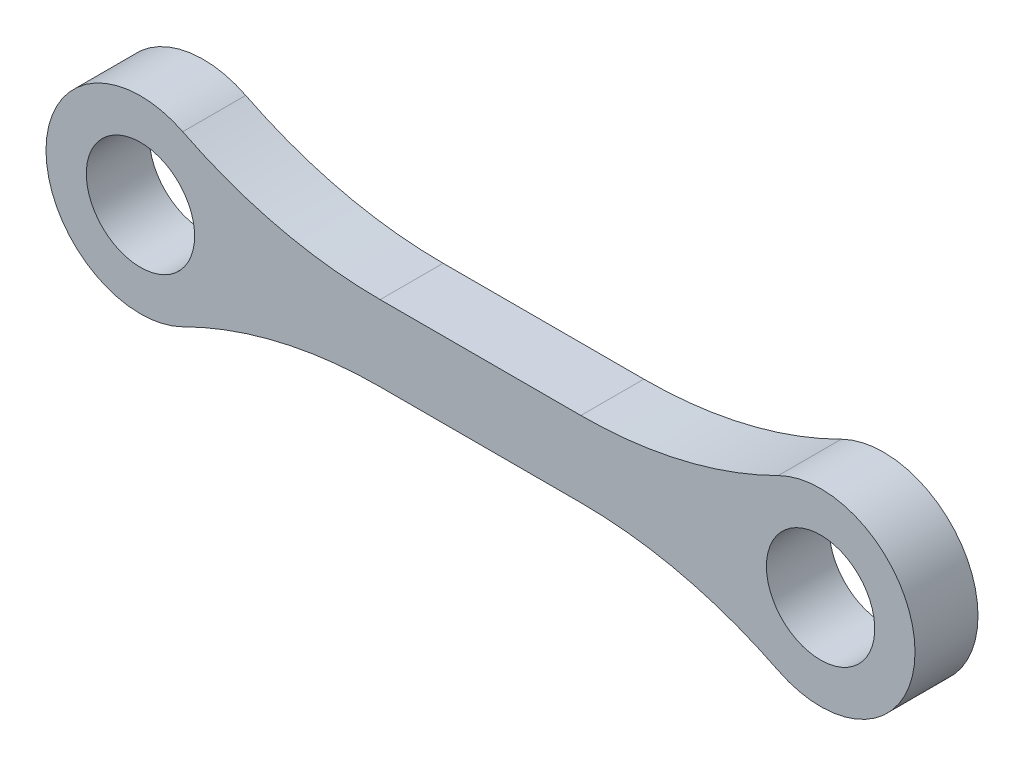
ISO-10303-21;
HEADER;
FILE_DESCRIPTION(('STEP AP214'),'2;1');
FILE_NAME('part.step','',(''),(''),'','','');
FILE_SCHEMA(('AUTOMOTIVE_DESIGN { 1 0 10303 214 1 1 1 1 }'));
ENDSEC;
DATA;
#1=APPLICATION_CONTEXT('core data for automotive mechanical design processes');
#2=APPLICATION_PROTOCOL_DEFINITION('international standard','automotive_design',2000,#1);
#3=PRODUCT_CONTEXT('',#1,'mechanical');
#4=PRODUCT('Part','Part','',(#3));
#5=PRODUCT_RELATED_PRODUCT_CATEGORY('part','',(#4));
#6=PRODUCT_DEFINITION_FORMATION('','',#4);
#7=PRODUCT_DEFINITION_CONTEXT('part definition',#1,'design');
#8=PRODUCT_DEFINITION('design','',#6,#7);
#9=PRODUCT_DEFINITION_SHAPE('','',#8);
#10=(LENGTH_UNIT() NAMED_UNIT(*) SI_UNIT(.MILLI.,.METRE.));
#11=(NAMED_UNIT(*) PLANE_ANGLE_UNIT() SI_UNIT($,.RADIAN.));
#12=(NAMED_UNIT(*) SI_UNIT($,.STERADIAN.) SOLID_ANGLE_UNIT());
#13=UNCERTAINTY_MEASURE_WITH_UNIT(LENGTH_MEASURE(1.E-05),#10,'distance_accuracy_value','');
#14=(GEOMETRIC_REPRESENTATION_CONTEXT(3) GLOBAL_UNCERTAINTY_ASSIGNED_CONTEXT((#13)) GLOBAL_UNIT_ASSIGNED_CONTEXT((#10,
#11,#12)) REPRESENTATION_CONTEXT('',''));
#15=CARTESIAN_POINT('',(0.,0.,0.));
#16=DIRECTION('',(0.,0.,1.));
#17=DIRECTION('',(1.,0.,0.));
#18=AXIS2_PLACEMENT_3D('',#15,#16,#17);
#19=CARTESIAN_POINT('',(7.96713368932572,-38.,5.));
#20=DIRECTION('',(0.,0.,-1.));
#21=DIRECTION('',(-1.,0.,0.));
#22=AXIS2_PLACEMENT_3D('',#19,#20,#21);
#23=PLANE('',#22);
#24=CARTESIAN_POINT('',(7.96713368932572,-38.,5.));
#25=DIRECTION('',(0.,0.,-1.));
#26=DIRECTION('',(-1.,0.,0.));
#27=AXIS2_PLACEMENT_3D('',#24,#25,#26);
#28=CIRCLE('',#27,35.);
#29=CARTESIAN_POINT('',(7.96713368932571,-3.,5.));
#30=VERTEX_POINT('',#29);
#31=CARTESIAN_POINT('',(23.6412588863516,-6.70588235294118,5.));
#32=VERTEX_POINT('',#31);
#33=EDGE_CURVE('E145',#30,#32,#28,.T.);
#34=ORIENTED_EDGE('',*,*,#33,.T.);
#35=CARTESIAN_POINT('',(27.,0.,5.));
#36=DIRECTION('',(0.,0.,1.));
#37=DIRECTION('',(-1.,0.,0.));
#38=AXIS2_PLACEMENT_3D('',#35,#36,#37);
#39=CIRCLE('',#38,7.5);
#40=CARTESIAN_POINT('',(23.6412588863516,6.70588235294117,5.));
#41=VERTEX_POINT('',#40);
#42=EDGE_CURVE('E93',#32,#41,#39,.T.);
#43=ORIENTED_EDGE('',*,*,#42,.T.);
#44=CARTESIAN_POINT('',(7.96713368932575,38.,5.));
#45=DIRECTION('',(0.,0.,-1.));
#46=DIRECTION('',(1.,0.,0.));
#47=AXIS2_PLACEMENT_3D('',#44,#45,#46);
#48=CIRCLE('',#47,35.);
#49=CARTESIAN_POINT('',(7.96713368932576,3.,5.));
#50=VERTEX_POINT('',#49);
#51=EDGE_CURVE('E160',#41,#50,#48,.T.);
#52=ORIENTED_EDGE('',*,*,#51,.T.);
#53=DIRECTION('',(-1.,0.,0.));
#54=VECTOR('',#53,1.);
#55=CARTESIAN_POINT('',(-7.96713368932575,3.,5.));
#56=LINE('',#55,#54);
#57=CARTESIAN_POINT('',(-7.96713368932576,3.,5.));
#58=VERTEX_POINT('',#57);
#59=EDGE_CURVE('E173',#50,#58,#56,.T.);
#60=ORIENTED_EDGE('',*,*,#59,.T.);
#61=CARTESIAN_POINT('',(-7.96713368932575,38.,5.));
#62=DIRECTION('',(0.,0.,-1.));
#63=DIRECTION('',(1.,0.,0.));
#64=AXIS2_PLACEMENT_3D('',#61,#62,#63);
#65=CIRCLE('',#64,35.);
#66=CARTESIAN_POINT('',(-23.6412588863516,6.70588235294117,5.));
#67=VERTEX_POINT('',#66);
#68=EDGE_CURVE('E112',#58,#67,#65,.T.);
#69=ORIENTED_EDGE('',*,*,#68,.T.);
#70=CARTESIAN_POINT('',(-27.,0.,5.));
#71=DIRECTION('',(0.,0.,1.));
#72=DIRECTION('',(1.,0.,0.));
#73=AXIS2_PLACEMENT_3D('',#70,#71,#72);
#74=CIRCLE('',#73,7.5);
#75=CARTESIAN_POINT('',(-23.6412588863516,-6.70588235294119,5.));
#76=VERTEX_POINT('',#75);
#77=EDGE_CURVE('E106',#67,#76,#74,.T.);
#78=ORIENTED_EDGE('',*,*,#77,.T.);
#79=CARTESIAN_POINT('',(-7.9671336893257,-38.,5.));
#80=DIRECTION('',(0.,0.,-1.));
#81=DIRECTION('',(-1.,0.,0.));
#82=AXIS2_PLACEMENT_3D('',#79,#80,#81);
#83=CIRCLE('',#82,35.);
#84=CARTESIAN_POINT('',(-7.9671336893257,-3.,5.));
#85=VERTEX_POINT('',#84);
#86=EDGE_CURVE('E110',#76,#85,#83,.T.);
#87=ORIENTED_EDGE('',*,*,#86,.T.);
#88=DIRECTION('',(1.,0.,0.));
#89=VECTOR('',#88,1.);
#90=CARTESIAN_POINT('',(-7.9671336893257,-3.,5.));
#91=LINE('',#90,#89);
#92=EDGE_CURVE('E50',#85,#30,#91,.T.);
#93=ORIENTED_EDGE('',*,*,#92,.T.);
#94=EDGE_LOOP('',(#34,#43,#52,#60,#69,#78,#87,#93));
#95=FACE_BOUND('',#94,.T.);
#96=CARTESIAN_POINT('',(-27.,0.,5.));
#97=DIRECTION('',(0.,0.,1.));
#98=DIRECTION('',(1.,0.,0.));
#99=AXIS2_PLACEMENT_3D('',#96,#97,#98);
#100=CIRCLE('',#99,4.3);
#101=CARTESIAN_POINT('',(-22.7,0.,5.));
#102=VERTEX_POINT('',#101);
#103=EDGE_CURVE('E134',#102,#102,#100,.T.);
#104=ORIENTED_EDGE('',*,*,#103,.F.);
#105=EDGE_LOOP('',(#104));
#106=FACE_BOUND('',#105,.T.);
#107=CARTESIAN_POINT('',(27.,0.,5.));
#108=DIRECTION('',(0.,0.,1.));
#109=DIRECTION('',(-1.,0.,0.));
#110=AXIS2_PLACEMENT_3D('',#107,#108,#109);
#111=CIRCLE('',#110,4.3);
#112=CARTESIAN_POINT('',(22.7,0.,5.));
#113=VERTEX_POINT('',#112);
#114=EDGE_CURVE('E182',#113,#113,#111,.T.);
#115=ORIENTED_EDGE('',*,*,#114,.F.);
#116=EDGE_LOOP('',(#115));
#117=FACE_BOUND('',#116,.T.);
#118=ADVANCED_FACE('F33',(#95,#106,#117),#23,.F.);
#119=CARTESIAN_POINT('',(7.96713368932572,-38.,0.));
#120=DIRECTION('',(0.,0.,-1.));
#121=DIRECTION('',(-1.,0.,0.));
#122=AXIS2_PLACEMENT_3D('',#119,#120,#121);
#123=PLANE('',#122);
#124=CARTESIAN_POINT('',(-27.,0.,0.));
#125=DIRECTION('',(0.,0.,1.));
#126=DIRECTION('',(1.,0.,0.));
#127=AXIS2_PLACEMENT_3D('',#124,#125,#126);
#128=CIRCLE('',#127,4.3);
#129=CARTESIAN_POINT('',(-22.7,0.,0.));
#130=VERTEX_POINT('',#129);
#131=EDGE_CURVE('E179',#130,#130,#128,.T.);
#132=ORIENTED_EDGE('',*,*,#131,.T.);
#133=EDGE_LOOP('',(#132));
#134=FACE_BOUND('',#133,.T.);
#135=CARTESIAN_POINT('',(7.96713368932572,-38.,0.));
#136=DIRECTION('',(0.,0.,-1.));
#137=DIRECTION('',(-1.,0.,0.));
#138=AXIS2_PLACEMENT_3D('',#135,#136,#137);
#139=CIRCLE('',#138,35.);
#140=CARTESIAN_POINT('',(7.96713368932571,-3.,0.));
#141=VERTEX_POINT('',#140);
#142=CARTESIAN_POINT('',(23.6412588863516,-6.70588235294118,0.));
#143=VERTEX_POINT('',#142);
#144=EDGE_CURVE('E130',#141,#143,#139,.T.);
#145=ORIENTED_EDGE('',*,*,#144,.F.);
#146=DIRECTION('',(1.,0.,0.));
#147=VECTOR('',#146,1.);
#148=CARTESIAN_POINT('',(-7.9671336893257,-3.,0.));
#149=LINE('',#148,#147);
#150=CARTESIAN_POINT('',(-7.9671336893257,-3.,0.));
#151=VERTEX_POINT('',#150);
#152=EDGE_CURVE('E85',#151,#141,#149,.T.);
#153=ORIENTED_EDGE('',*,*,#152,.F.);
#154=CARTESIAN_POINT('',(-7.9671336893257,-38.,0.));
#155=DIRECTION('',(0.,0.,-1.));
#156=DIRECTION('',(-1.,0.,0.));
#157=AXIS2_PLACEMENT_3D('',#154,#155,#156);
#158=CIRCLE('',#157,35.);
#159=CARTESIAN_POINT('',(-23.6412588863516,-6.70588235294119,0.));
#160=VERTEX_POINT('',#159);
#161=EDGE_CURVE('E79',#160,#151,#158,.T.);
#162=ORIENTED_EDGE('',*,*,#161,.F.);
#163=CARTESIAN_POINT('',(-27.,0.,0.));
#164=DIRECTION('',(0.,0.,1.));
#165=DIRECTION('',(1.,0.,0.));
#166=AXIS2_PLACEMENT_3D('',#163,#164,#165);
#167=CIRCLE('',#166,7.5);
#168=CARTESIAN_POINT('',(-23.6412588863516,6.70588235294117,0.));
#169=VERTEX_POINT('',#168);
#170=EDGE_CURVE('E120',#169,#160,#167,.T.);
#171=ORIENTED_EDGE('',*,*,#170,.F.);
#172=CARTESIAN_POINT('',(-7.96713368932575,38.,0.));
#173=DIRECTION('',(0.,0.,-1.));
#174=DIRECTION('',(1.,0.,0.));
#175=AXIS2_PLACEMENT_3D('',#172,#173,#174);
#176=CIRCLE('',#175,35.);
#177=CARTESIAN_POINT('',(-7.96713368932576,3.,0.));
#178=VERTEX_POINT('',#177);
#179=EDGE_CURVE('E140',#178,#169,#176,.T.);
#180=ORIENTED_EDGE('',*,*,#179,.F.);
#181=DIRECTION('',(-1.,0.,0.));
#182=VECTOR('',#181,1.);
#183=CARTESIAN_POINT('',(-7.96713368932575,3.,0.));
#184=LINE('',#183,#182);
#185=CARTESIAN_POINT('',(7.96713368932576,3.,0.));
#186=VERTEX_POINT('',#185);
#187=EDGE_CURVE('E138',#186,#178,#184,.T.);
#188=ORIENTED_EDGE('',*,*,#187,.F.);
#189=CARTESIAN_POINT('',(7.96713368932575,38.,0.));
#190=DIRECTION('',(0.,0.,-1.));
#191=DIRECTION('',(1.,0.,0.));
#192=AXIS2_PLACEMENT_3D('',#189,#190,#191);
#193=CIRCLE('',#192,35.);
#194=CARTESIAN_POINT('',(23.6412588863516,6.70588235294117,0.));
#195=VERTEX_POINT('',#194);
#196=EDGE_CURVE('E136',#195,#186,#193,.T.);
#197=ORIENTED_EDGE('',*,*,#196,.F.);
#198=CARTESIAN_POINT('',(27.,0.,0.));
#199=DIRECTION('',(0.,0.,1.));
#200=DIRECTION('',(-1.,0.,0.));
#201=AXIS2_PLACEMENT_3D('',#198,#199,#200);
#202=CIRCLE('',#201,7.5);
#203=EDGE_CURVE('E133',#143,#195,#202,.T.);
#204=ORIENTED_EDGE('',*,*,#203,.F.);
#205=EDGE_LOOP('',(#145,#153,#162,#171,#180,#188,#197,#204));
#206=FACE_BOUND('',#205,.T.);
#207=CARTESIAN_POINT('',(27.,0.,0.));
#208=DIRECTION('',(0.,0.,1.));
#209=DIRECTION('',(-1.,0.,0.));
#210=AXIS2_PLACEMENT_3D('',#207,#208,#209);
#211=CIRCLE('',#210,4.3);
#212=CARTESIAN_POINT('',(22.7,0.,0.));
#213=VERTEX_POINT('',#212);
#214=EDGE_CURVE('E185',#213,#213,#211,.T.);
#215=ORIENTED_EDGE('',*,*,#214,.T.);
#216=EDGE_LOOP('',(#215));
#217=FACE_BOUND('',#216,.T.);
#218=ADVANCED_FACE('F164',(#134,#206,#217),#123,.T.);
#219=CARTESIAN_POINT('',(7.96713368932572,-38.,5.));
#220=DIRECTION('',(0.,0.,-1.));
#221=DIRECTION('',(-1.,0.,0.));
#222=AXIS2_PLACEMENT_3D('',#219,#220,#221);
#223=CYLINDRICAL_SURFACE('',#222,35.);
#224=ORIENTED_EDGE('',*,*,#144,.T.);
#225=DIRECTION('',(0.,0.,-1.));
#226=VECTOR('',#225,1.);
#227=CARTESIAN_POINT('',(23.6412588863516,-6.70588235294118,5.));
#228=LINE('',#227,#226);
#229=EDGE_CURVE('E11',#32,#143,#228,.T.);
#230=ORIENTED_EDGE('',*,*,#229,.F.);
#231=ORIENTED_EDGE('',*,*,#33,.F.);
#232=DIRECTION('',(0.,0.,-1.));
#233=VECTOR('',#232,1.);
#234=CARTESIAN_POINT('',(7.96713368932571,-3.,5.));
#235=LINE('',#234,#233);
#236=EDGE_CURVE('E126',#30,#141,#235,.T.);
#237=ORIENTED_EDGE('',*,*,#236,.T.);
#238=EDGE_LOOP('',(#224,#230,#231,#237));
#239=FACE_BOUND('',#238,.T.);
#240=ADVANCED_FACE('F35',(#239),#223,.F.);
#241=CARTESIAN_POINT('',(27.,0.,5.));
#242=DIRECTION('',(0.,0.,-1.));
#243=DIRECTION('',(-1.,0.,0.));
#244=AXIS2_PLACEMENT_3D('',#241,#242,#243);
#245=CYLINDRICAL_SURFACE('',#244,7.5);
#246=ORIENTED_EDGE('',*,*,#203,.T.);
#247=DIRECTION('',(0.,0.,-1.));
#248=VECTOR('',#247,1.);
#249=CARTESIAN_POINT('',(23.6412588863516,6.70588235294117,5.));
#250=LINE('',#249,#248);
#251=EDGE_CURVE('E42',#41,#195,#250,.T.);
#252=ORIENTED_EDGE('',*,*,#251,.F.);
#253=ORIENTED_EDGE('',*,*,#42,.F.);
#254=ORIENTED_EDGE('',*,*,#229,.T.);
#255=EDGE_LOOP('',(#246,#252,#253,#254));
#256=FACE_BOUND('',#255,.T.);
#257=ADVANCED_FACE('F217',(#256),#245,.T.);
#258=CARTESIAN_POINT('',(7.96713368932575,38.,5.));
#259=DIRECTION('',(0.,0.,-1.));
#260=DIRECTION('',(-1.,0.,0.));
#261=AXIS2_PLACEMENT_3D('',#258,#259,#260);
#262=CYLINDRICAL_SURFACE('',#261,35.);
#263=ORIENTED_EDGE('',*,*,#196,.T.);
#264=DIRECTION('',(0.,0.,-1.));
#265=VECTOR('',#264,1.);
#266=CARTESIAN_POINT('',(7.96713368932576,3.,5.));
#267=LINE('',#266,#265);
#268=EDGE_CURVE('E152',#50,#186,#267,.T.);
#269=ORIENTED_EDGE('',*,*,#268,.F.);
#270=ORIENTED_EDGE('',*,*,#51,.F.);
#271=ORIENTED_EDGE('',*,*,#251,.T.);
#272=EDGE_LOOP('',(#263,#269,#270,#271));
#273=FACE_BOUND('',#272,.T.);
#274=ADVANCED_FACE('F158',(#273),#262,.F.);
#275=CARTESIAN_POINT('',(-7.96713368932575,3.,5.));
#276=DIRECTION('',(0.,-1.,0.));
#277=DIRECTION('',(1.,0.,0.));
#278=AXIS2_PLACEMENT_3D('',#275,#276,#277);
#279=PLANE('',#278);
#280=ORIENTED_EDGE('',*,*,#187,.T.);
#281=DIRECTION('',(0.,0.,-1.));
#282=VECTOR('',#281,1.);
#283=CARTESIAN_POINT('',(-7.96713368932576,3.,5.));
#284=LINE('',#283,#282);
#285=EDGE_CURVE('E149',#58,#178,#284,.T.);
#286=ORIENTED_EDGE('',*,*,#285,.F.);
#287=ORIENTED_EDGE('',*,*,#59,.F.);
#288=ORIENTED_EDGE('',*,*,#268,.T.);
#289=EDGE_LOOP('',(#280,#286,#287,#288));
#290=FACE_BOUND('',#289,.T.);
#291=ADVANCED_FACE('F169',(#290),#279,.F.);
#292=CARTESIAN_POINT('',(-7.96713368932575,38.,5.));
#293=DIRECTION('',(0.,0.,-1.));
#294=DIRECTION('',(-1.,0.,0.));
#295=AXIS2_PLACEMENT_3D('',#292,#293,#294);
#296=CYLINDRICAL_SURFACE('',#295,35.);
#297=ORIENTED_EDGE('',*,*,#179,.T.);
#298=DIRECTION('',(0.,0.,-1.));
#299=VECTOR('',#298,1.);
#300=CARTESIAN_POINT('',(-23.6412588863516,6.70588235294117,5.));
#301=LINE('',#300,#299);
#302=EDGE_CURVE('E121',#67,#169,#301,.T.);
#303=ORIENTED_EDGE('',*,*,#302,.F.);
#304=ORIENTED_EDGE('',*,*,#68,.F.);
#305=ORIENTED_EDGE('',*,*,#285,.T.);
#306=EDGE_LOOP('',(#297,#303,#304,#305));
#307=FACE_BOUND('',#306,.T.);
#308=ADVANCED_FACE('F172',(#307),#296,.F.);
#309=CARTESIAN_POINT('',(-27.,0.,5.));
#310=DIRECTION('',(0.,0.,-1.));
#311=DIRECTION('',(-1.,0.,0.));
#312=AXIS2_PLACEMENT_3D('',#309,#310,#311);
#313=CYLINDRICAL_SURFACE('',#312,7.5);
#314=ORIENTED_EDGE('',*,*,#170,.T.);
#315=DIRECTION('',(0.,0.,-1.));
#316=VECTOR('',#315,1.);
#317=CARTESIAN_POINT('',(-23.6412588863516,-6.70588235294119,5.));
#318=LINE('',#317,#316);
#319=EDGE_CURVE('E117',#76,#160,#318,.T.);
#320=ORIENTED_EDGE('',*,*,#319,.F.);
#321=ORIENTED_EDGE('',*,*,#77,.F.);
#322=ORIENTED_EDGE('',*,*,#302,.T.);
#323=EDGE_LOOP('',(#314,#320,#321,#322));
#324=FACE_BOUND('',#323,.T.);
#325=ADVANCED_FACE('F118',(#324),#313,.T.);
#326=CARTESIAN_POINT('',(-7.9671336893257,-38.,5.));
#327=DIRECTION('',(0.,0.,-1.));
#328=DIRECTION('',(-1.,0.,0.));
#329=AXIS2_PLACEMENT_3D('',#326,#327,#328);
#330=CYLINDRICAL_SURFACE('',#329,35.);
#331=ORIENTED_EDGE('',*,*,#161,.T.);
#332=DIRECTION('',(0.,0.,-1.));
#333=VECTOR('',#332,1.);
#334=CARTESIAN_POINT('',(-7.9671336893257,-3.,5.));
#335=LINE('',#334,#333);
#336=EDGE_CURVE('E122',#85,#151,#335,.T.);
#337=ORIENTED_EDGE('',*,*,#336,.F.);
#338=ORIENTED_EDGE('',*,*,#86,.F.);
#339=ORIENTED_EDGE('',*,*,#319,.T.);
#340=EDGE_LOOP('',(#331,#337,#338,#339));
#341=FACE_BOUND('',#340,.T.);
#342=ADVANCED_FACE('F124',(#341),#330,.F.);
#343=CARTESIAN_POINT('',(-7.9671336893257,-3.,5.));
#344=DIRECTION('',(0.,1.,0.));
#345=DIRECTION('',(-1.,0.,0.));
#346=AXIS2_PLACEMENT_3D('',#343,#344,#345);
#347=PLANE('',#346);
#348=ORIENTED_EDGE('',*,*,#152,.T.);
#349=ORIENTED_EDGE('',*,*,#236,.F.);
#350=ORIENTED_EDGE('',*,*,#92,.F.);
#351=ORIENTED_EDGE('',*,*,#336,.T.);
#352=EDGE_LOOP('',(#348,#349,#350,#351));
#353=FACE_BOUND('',#352,.T.);
#354=ADVANCED_FACE('F205',(#353),#347,.F.);
#355=CARTESIAN_POINT('',(-27.,0.,5.));
#356=DIRECTION('',(0.,0.,-1.));
#357=DIRECTION('',(-1.,0.,0.));
#358=AXIS2_PLACEMENT_3D('',#355,#356,#357);
#359=CYLINDRICAL_SURFACE('',#358,4.3);
#360=ORIENTED_EDGE('',*,*,#103,.T.);
#361=EDGE_LOOP('',(#360));
#362=FACE_BOUND('',#361,.T.);
#363=ORIENTED_EDGE('',*,*,#131,.F.);
#364=EDGE_LOOP('',(#363));
#365=FACE_BOUND('',#364,.T.);
#366=ADVANCED_FACE('F202',(#362,#365),#359,.F.);
#367=CARTESIAN_POINT('',(27.,0.,5.));
#368=DIRECTION('',(0.,0.,-1.));
#369=DIRECTION('',(-1.,0.,0.));
#370=AXIS2_PLACEMENT_3D('',#367,#368,#369);
#371=CYLINDRICAL_SURFACE('',#370,4.3);
#372=ORIENTED_EDGE('',*,*,#114,.T.);
#373=EDGE_LOOP('',(#372));
#374=FACE_BOUND('',#373,.T.);
#375=ORIENTED_EDGE('',*,*,#214,.F.);
#376=EDGE_LOOP('',(#375));
#377=FACE_BOUND('',#376,.T.);
#378=ADVANCED_FACE('F191',(#374,#377),#371,.F.);
#379=CLOSED_SHELL('',(#118,#218,#240,#257,#274,#291,#308,#325,#342,#354,#366,#378));
#380=MANIFOLD_SOLID_BREP('B2',#379);
#381=ADVANCED_BREP_SHAPE_REPRESENTATION('',(#18,#380),#14);
#382=SHAPE_DEFINITION_REPRESENTATION(#9,#381);
ENDSEC;
END-ISO-10303-21;
